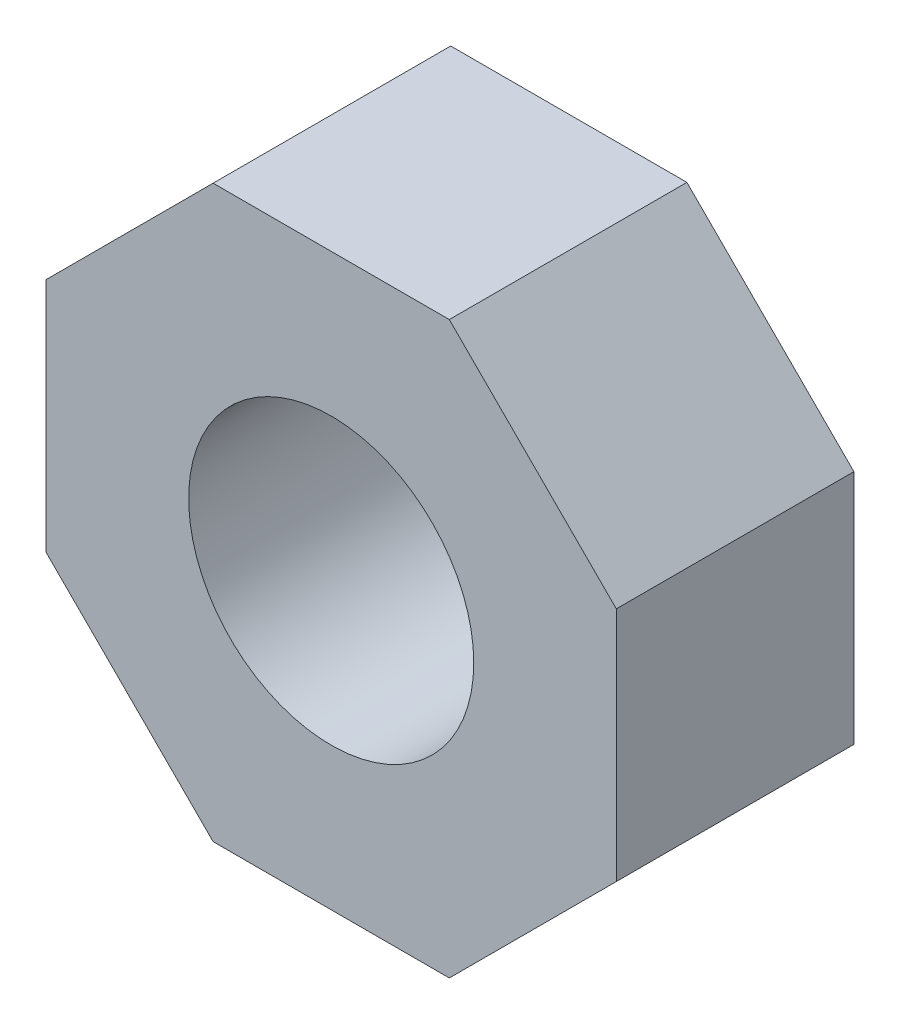
ISO-10303-21;
HEADER;
FILE_DESCRIPTION(('STEP AP214'),'2;1');
FILE_NAME('part.step','',(''),(''),'','','');
FILE_SCHEMA(('AUTOMOTIVE_DESIGN { 1 0 10303 214 1 1 1 1 }'));
ENDSEC;
DATA;
#1=APPLICATION_CONTEXT('core data for automotive mechanical design processes');
#2=APPLICATION_PROTOCOL_DEFINITION('international standard','automotive_design',2000,#1);
#3=PRODUCT_CONTEXT('',#1,'mechanical');
#4=PRODUCT('Part','Part','',(#3));
#5=PRODUCT_RELATED_PRODUCT_CATEGORY('part','',(#4));
#6=PRODUCT_DEFINITION_FORMATION('','',#4);
#7=PRODUCT_DEFINITION_CONTEXT('part definition',#1,'design');
#8=PRODUCT_DEFINITION('design','',#6,#7);
#9=PRODUCT_DEFINITION_SHAPE('','',#8);
#10=(LENGTH_UNIT() NAMED_UNIT(*) SI_UNIT(.MILLI.,.METRE.));
#11=(NAMED_UNIT(*) PLANE_ANGLE_UNIT() SI_UNIT($,.RADIAN.));
#12=(NAMED_UNIT(*) SI_UNIT($,.STERADIAN.) SOLID_ANGLE_UNIT());
#13=UNCERTAINTY_MEASURE_WITH_UNIT(LENGTH_MEASURE(1.E-05),#10,'distance_accuracy_value','');
#14=(GEOMETRIC_REPRESENTATION_CONTEXT(3) GLOBAL_UNCERTAINTY_ASSIGNED_CONTEXT((#13)) GLOBAL_UNIT_ASSIGNED_CONTEXT((#10,
#11,#12)) REPRESENTATION_CONTEXT('',''));
#15=CARTESIAN_POINT('',(0.,0.,0.));
#16=DIRECTION('',(0.,0.,1.));
#17=DIRECTION('',(1.,0.,0.));
#18=AXIS2_PLACEMENT_3D('',#15,#16,#17);
#19=CARTESIAN_POINT('',(-6.,0.,5.));
#20=DIRECTION('',(-1.,0.,0.));
#21=DIRECTION('',(0.,0.,1.));
#22=AXIS2_PLACEMENT_3D('',#19,#20,#21);
#23=PLANE('',#22);
#24=DIRECTION('',(0.,1.,0.));
#25=VECTOR('',#24,1.);
#26=CARTESIAN_POINT('',(-6.,0.,0.));
#27=LINE('',#26,#25);
#28=CARTESIAN_POINT('',(-6.,-2.48528137423859,0.));
#29=VERTEX_POINT('',#28);
#30=CARTESIAN_POINT('',(-6.,2.48528137423859,0.));
#31=VERTEX_POINT('',#30);
#32=EDGE_CURVE('E133',#29,#31,#27,.T.);
#33=ORIENTED_EDGE('',*,*,#32,.F.);
#34=DIRECTION('',(0.,0.,-1.));
#35=VECTOR('',#34,1.);
#36=CARTESIAN_POINT('',(-6.,-2.48528137423859,5.));
#37=LINE('',#36,#35);
#38=CARTESIAN_POINT('',(-6.,-2.48528137423859,5.));
#39=VERTEX_POINT('',#38);
#40=EDGE_CURVE('E11',#39,#29,#37,.T.);
#41=ORIENTED_EDGE('',*,*,#40,.F.);
#42=DIRECTION('',(0.,1.,0.));
#43=VECTOR('',#42,1.);
#44=CARTESIAN_POINT('',(-6.,0.,5.));
#45=LINE('',#44,#43);
#46=CARTESIAN_POINT('',(-6.,2.48528137423859,5.));
#47=VERTEX_POINT('',#46);
#48=EDGE_CURVE('E299',#39,#47,#45,.T.);
#49=ORIENTED_EDGE('',*,*,#48,.T.);
#50=DIRECTION('',(0.,0.,-1.));
#51=VECTOR('',#50,1.);
#52=CARTESIAN_POINT('',(-6.,2.48528137423859,5.));
#53=LINE('',#52,#51);
#54=EDGE_CURVE('E53',#47,#31,#53,.T.);
#55=ORIENTED_EDGE('',*,*,#54,.T.);
#56=EDGE_LOOP('',(#33,#41,#49,#55));
#57=FACE_BOUND('',#56,.T.);
#58=ADVANCED_FACE('F36',(#57),#23,.T.);
#59=CARTESIAN_POINT('',(-4.24264068711926,-4.24264068711931,5.));
#60=DIRECTION('',(-0.707106781186543,-0.707106781186552,0.));
#61=DIRECTION('',(0.707106781186552,-0.707106781186543,0.));
#62=AXIS2_PLACEMENT_3D('',#59,#60,#61);
#63=PLANE('',#62);
#64=DIRECTION('',(-0.707106781186552,0.707106781186543,0.));
#65=VECTOR('',#64,1.);
#66=CARTESIAN_POINT('',(-4.24264068711926,-4.24264068711931,0.));
#67=LINE('',#66,#65);
#68=CARTESIAN_POINT('',(-2.48528137423858,-6.,0.));
#69=VERTEX_POINT('',#68);
#70=EDGE_CURVE('E135',#69,#29,#67,.T.);
#71=ORIENTED_EDGE('',*,*,#70,.F.);
#72=DIRECTION('',(0.,0.,-1.));
#73=VECTOR('',#72,1.);
#74=CARTESIAN_POINT('',(-2.48528137423858,-6.,5.));
#75=LINE('',#74,#73);
#76=CARTESIAN_POINT('',(-2.48528137423858,-6.,5.));
#77=VERTEX_POINT('',#76);
#78=EDGE_CURVE('E45',#77,#69,#75,.T.);
#79=ORIENTED_EDGE('',*,*,#78,.F.);
#80=DIRECTION('',(-0.707106781186552,0.707106781186543,0.));
#81=VECTOR('',#80,1.);
#82=CARTESIAN_POINT('',(-4.24264068711926,-4.24264068711931,5.));
#83=LINE('',#82,#81);
#84=EDGE_CURVE('E174',#77,#39,#83,.T.);
#85=ORIENTED_EDGE('',*,*,#84,.T.);
#86=ORIENTED_EDGE('',*,*,#40,.T.);
#87=EDGE_LOOP('',(#71,#79,#85,#86));
#88=FACE_BOUND('',#87,.T.);
#89=ADVANCED_FACE('F173',(#88),#63,.T.);
#90=CARTESIAN_POINT('',(0.,-6.,5.));
#91=DIRECTION('',(0.,1.,0.));
#92=DIRECTION('',(0.,0.,1.));
#93=AXIS2_PLACEMENT_3D('',#90,#91,#92);
#94=PLANE('',#93);
#95=DIRECTION('',(1.,0.,0.));
#96=VECTOR('',#95,1.);
#97=CARTESIAN_POINT('',(0.,-6.,0.));
#98=LINE('',#97,#96);
#99=CARTESIAN_POINT('',(2.48528137423857,-6.,0.));
#100=VERTEX_POINT('',#99);
#101=EDGE_CURVE('E138',#69,#100,#98,.T.);
#102=ORIENTED_EDGE('',*,*,#101,.T.);
#103=DIRECTION('',(0.,0.,-1.));
#104=VECTOR('',#103,1.);
#105=CARTESIAN_POINT('',(2.48528137423857,-6.,5.));
#106=LINE('',#105,#104);
#107=CARTESIAN_POINT('',(2.48528137423857,-6.,5.));
#108=VERTEX_POINT('',#107);
#109=EDGE_CURVE('E159',#108,#100,#106,.T.);
#110=ORIENTED_EDGE('',*,*,#109,.F.);
#111=DIRECTION('',(1.,0.,0.));
#112=VECTOR('',#111,1.);
#113=CARTESIAN_POINT('',(0.,-6.,5.));
#114=LINE('',#113,#112);
#115=EDGE_CURVE('E165',#77,#108,#114,.T.);
#116=ORIENTED_EDGE('',*,*,#115,.F.);
#117=ORIENTED_EDGE('',*,*,#78,.T.);
#118=EDGE_LOOP('',(#102,#110,#116,#117));
#119=FACE_BOUND('',#118,.T.);
#120=ADVANCED_FACE('F163',(#119),#94,.F.);
#121=CARTESIAN_POINT('',(4.24264068711929,-4.24264068711928,5.));
#122=DIRECTION('',(0.707106781186548,-0.707106781186547,0.));
#123=DIRECTION('',(0.707106781186547,0.707106781186548,0.));
#124=AXIS2_PLACEMENT_3D('',#121,#122,#123);
#125=PLANE('',#124);
#126=DIRECTION('',(-0.707106781186547,-0.707106781186548,0.));
#127=VECTOR('',#126,1.);
#128=CARTESIAN_POINT('',(4.24264068711929,-4.24264068711928,0.));
#129=LINE('',#128,#127);
#130=CARTESIAN_POINT('',(6.,-2.48528137423857,0.));
#131=VERTEX_POINT('',#130);
#132=EDGE_CURVE('E141',#131,#100,#129,.T.);
#133=ORIENTED_EDGE('',*,*,#132,.F.);
#134=DIRECTION('',(0.,0.,-1.));
#135=VECTOR('',#134,1.);
#136=CARTESIAN_POINT('',(6.,-2.48528137423857,5.));
#137=LINE('',#136,#135);
#138=CARTESIAN_POINT('',(6.,-2.48528137423857,5.));
#139=VERTEX_POINT('',#138);
#140=EDGE_CURVE('E157',#139,#131,#137,.T.);
#141=ORIENTED_EDGE('',*,*,#140,.F.);
#142=DIRECTION('',(-0.707106781186547,-0.707106781186548,0.));
#143=VECTOR('',#142,1.);
#144=CARTESIAN_POINT('',(4.24264068711929,-4.24264068711928,5.));
#145=LINE('',#144,#143);
#146=EDGE_CURVE('E294',#139,#108,#145,.T.);
#147=ORIENTED_EDGE('',*,*,#146,.T.);
#148=ORIENTED_EDGE('',*,*,#109,.T.);
#149=EDGE_LOOP('',(#133,#141,#147,#148));
#150=FACE_BOUND('',#149,.T.);
#151=ADVANCED_FACE('F195',(#150),#125,.T.);
#152=CARTESIAN_POINT('',(6.,0.,5.));
#153=DIRECTION('',(1.,0.,0.));
#154=DIRECTION('',(0.,1.,0.));
#155=AXIS2_PLACEMENT_3D('',#152,#153,#154);
#156=PLANE('',#155);
#157=DIRECTION('',(0.,-1.,0.));
#158=VECTOR('',#157,1.);
#159=CARTESIAN_POINT('',(6.,0.,0.));
#160=LINE('',#159,#158);
#161=CARTESIAN_POINT('',(6.,2.48528137423857,0.));
#162=VERTEX_POINT('',#161);
#163=EDGE_CURVE('E144',#162,#131,#160,.T.);
#164=ORIENTED_EDGE('',*,*,#163,.F.);
#165=DIRECTION('',(0.,0.,-1.));
#166=VECTOR('',#165,1.);
#167=CARTESIAN_POINT('',(6.,2.48528137423857,5.));
#168=LINE('',#167,#166);
#169=CARTESIAN_POINT('',(6.,2.48528137423857,5.));
#170=VERTEX_POINT('',#169);
#171=EDGE_CURVE('E112',#170,#162,#168,.T.);
#172=ORIENTED_EDGE('',*,*,#171,.F.);
#173=DIRECTION('',(0.,-1.,0.));
#174=VECTOR('',#173,1.);
#175=CARTESIAN_POINT('',(6.,0.,5.));
#176=LINE('',#175,#174);
#177=EDGE_CURVE('E122',#170,#139,#176,.T.);
#178=ORIENTED_EDGE('',*,*,#177,.T.);
#179=ORIENTED_EDGE('',*,*,#140,.T.);
#180=EDGE_LOOP('',(#164,#172,#178,#179));
#181=FACE_BOUND('',#180,.T.);
#182=ADVANCED_FACE('F198',(#181),#156,.T.);
#183=CARTESIAN_POINT('',(4.24264068711928,4.24264068711929,5.));
#184=DIRECTION('',(0.707106781186547,0.707106781186548,0.));
#185=DIRECTION('',(-0.707106781186548,0.707106781186547,0.));
#186=AXIS2_PLACEMENT_3D('',#183,#184,#185);
#187=PLANE('',#186);
#188=DIRECTION('',(0.707106781186548,-0.707106781186547,0.));
#189=VECTOR('',#188,1.);
#190=CARTESIAN_POINT('',(4.24264068711928,4.24264068711929,0.));
#191=LINE('',#190,#189);
#192=CARTESIAN_POINT('',(2.48528137423857,6.,0.));
#193=VERTEX_POINT('',#192);
#194=EDGE_CURVE('E108',#193,#162,#191,.T.);
#195=ORIENTED_EDGE('',*,*,#194,.F.);
#196=DIRECTION('',(0.,0.,-1.));
#197=VECTOR('',#196,1.);
#198=CARTESIAN_POINT('',(2.48528137423857,6.,5.));
#199=LINE('',#198,#197);
#200=CARTESIAN_POINT('',(2.48528137423857,6.,5.));
#201=VERTEX_POINT('',#200);
#202=EDGE_CURVE('E103',#201,#193,#199,.T.);
#203=ORIENTED_EDGE('',*,*,#202,.F.);
#204=DIRECTION('',(0.707106781186548,-0.707106781186547,0.));
#205=VECTOR('',#204,1.);
#206=CARTESIAN_POINT('',(4.24264068711928,4.24264068711929,5.));
#207=LINE('',#206,#205);
#208=EDGE_CURVE('E106',#201,#170,#207,.T.);
#209=ORIENTED_EDGE('',*,*,#208,.T.);
#210=ORIENTED_EDGE('',*,*,#171,.T.);
#211=EDGE_LOOP('',(#195,#203,#209,#210));
#212=FACE_BOUND('',#211,.T.);
#213=ADVANCED_FACE('F105',(#212),#187,.T.);
#214=CARTESIAN_POINT('',(0.,6.,5.));
#215=DIRECTION('',(0.,1.,0.));
#216=DIRECTION('',(-1.,0.,0.));
#217=AXIS2_PLACEMENT_3D('',#214,#215,#216);
#218=PLANE('',#217);
#219=DIRECTION('',(1.,0.,0.));
#220=VECTOR('',#219,1.);
#221=CARTESIAN_POINT('',(0.,6.,0.));
#222=LINE('',#221,#220);
#223=CARTESIAN_POINT('',(-2.48528137423856,6.,0.));
#224=VERTEX_POINT('',#223);
#225=EDGE_CURVE('E148',#224,#193,#222,.T.);
#226=ORIENTED_EDGE('',*,*,#225,.F.);
#227=DIRECTION('',(0.,0.,-1.));
#228=VECTOR('',#227,1.);
#229=CARTESIAN_POINT('',(-2.48528137423856,6.,5.));
#230=LINE('',#229,#228);
#231=CARTESIAN_POINT('',(-2.48528137423856,6.,5.));
#232=VERTEX_POINT('',#231);
#233=EDGE_CURVE('E78',#232,#224,#230,.T.);
#234=ORIENTED_EDGE('',*,*,#233,.F.);
#235=DIRECTION('',(1.,0.,0.));
#236=VECTOR('',#235,1.);
#237=CARTESIAN_POINT('',(0.,6.,5.));
#238=LINE('',#237,#236);
#239=EDGE_CURVE('E119',#232,#201,#238,.T.);
#240=ORIENTED_EDGE('',*,*,#239,.T.);
#241=ORIENTED_EDGE('',*,*,#202,.T.);
#242=EDGE_LOOP('',(#226,#234,#240,#241));
#243=FACE_BOUND('',#242,.T.);
#244=ADVANCED_FACE('F124',(#243),#218,.T.);
#245=CARTESIAN_POINT('',(0.,0.,5.));
#246=DIRECTION('',(0.,0.,-1.));
#247=DIRECTION('',(-1.,0.,0.));
#248=AXIS2_PLACEMENT_3D('',#245,#246,#247);
#249=CYLINDRICAL_SURFACE('',#248,3.);
#250=CARTESIAN_POINT('',(0.,0.,5.));
#251=DIRECTION('',(0.,0.,1.));
#252=DIRECTION('',(1.,0.,0.));
#253=AXIS2_PLACEMENT_3D('',#250,#251,#252);
#254=CIRCLE('',#253,3.);
#255=CARTESIAN_POINT('',(3.,0.,5.));
#256=VERTEX_POINT('',#255);
#257=EDGE_CURVE('E153',#256,#256,#254,.T.);
#258=ORIENTED_EDGE('',*,*,#257,.T.);
#259=EDGE_LOOP('',(#258));
#260=FACE_BOUND('',#259,.T.);
#261=CARTESIAN_POINT('',(0.,0.,0.));
#262=DIRECTION('',(0.,0.,1.));
#263=DIRECTION('',(1.,0.,0.));
#264=AXIS2_PLACEMENT_3D('',#261,#262,#263);
#265=CIRCLE('',#264,3.);
#266=CARTESIAN_POINT('',(3.,0.,0.));
#267=VERTEX_POINT('',#266);
#268=EDGE_CURVE('E130',#267,#267,#265,.T.);
#269=ORIENTED_EDGE('',*,*,#268,.F.);
#270=EDGE_LOOP('',(#269));
#271=FACE_BOUND('',#270,.T.);
#272=ADVANCED_FACE('F38',(#260,#271),#249,.F.);
#273=CARTESIAN_POINT('',(-4.24264068711927,4.2426406871193,5.));
#274=DIRECTION('',(-0.707106781186545,0.70710678118655,0.));
#275=DIRECTION('',(-0.70710678118655,-0.707106781186545,0.));
#276=AXIS2_PLACEMENT_3D('',#273,#274,#275);
#277=PLANE('',#276);
#278=DIRECTION('',(0.70710678118655,0.707106781186545,0.));
#279=VECTOR('',#278,1.);
#280=CARTESIAN_POINT('',(-4.24264068711927,4.2426406871193,0.));
#281=LINE('',#280,#279);
#282=EDGE_CURVE('E150',#31,#224,#281,.T.);
#283=ORIENTED_EDGE('',*,*,#282,.F.);
#284=ORIENTED_EDGE('',*,*,#54,.F.);
#285=DIRECTION('',(0.70710678118655,0.707106781186545,0.));
#286=VECTOR('',#285,1.);
#287=CARTESIAN_POINT('',(-4.24264068711927,4.2426406871193,5.));
#288=LINE('',#287,#286);
#289=EDGE_CURVE('E125',#47,#232,#288,.T.);
#290=ORIENTED_EDGE('',*,*,#289,.T.);
#291=ORIENTED_EDGE('',*,*,#233,.T.);
#292=EDGE_LOOP('',(#283,#284,#290,#291));
#293=FACE_BOUND('',#292,.T.);
#294=ADVANCED_FACE('F175',(#293),#277,.T.);
#295=CARTESIAN_POINT('',(0.,0.,5.));
#296=DIRECTION('',(0.,0.,1.));
#297=DIRECTION('',(1.,0.,0.));
#298=AXIS2_PLACEMENT_3D('',#295,#296,#297);
#299=PLANE('',#298);
#300=ORIENTED_EDGE('',*,*,#257,.F.);
#301=EDGE_LOOP('',(#300));
#302=FACE_BOUND('',#301,.T.);
#303=ORIENTED_EDGE('',*,*,#48,.F.);
#304=ORIENTED_EDGE('',*,*,#84,.F.);
#305=ORIENTED_EDGE('',*,*,#115,.T.);
#306=ORIENTED_EDGE('',*,*,#146,.F.);
#307=ORIENTED_EDGE('',*,*,#177,.F.);
#308=ORIENTED_EDGE('',*,*,#208,.F.);
#309=ORIENTED_EDGE('',*,*,#239,.F.);
#310=ORIENTED_EDGE('',*,*,#289,.F.);
#311=EDGE_LOOP('',(#303,#304,#305,#306,#307,#308,#309,#310));
#312=FACE_BOUND('',#311,.T.);
#313=ADVANCED_FACE('F117',(#302,#312),#299,.T.);
#314=CARTESIAN_POINT('',(0.,0.,0.));
#315=DIRECTION('',(0.,0.,1.));
#316=DIRECTION('',(1.,0.,0.));
#317=AXIS2_PLACEMENT_3D('',#314,#315,#316);
#318=PLANE('',#317);
#319=ORIENTED_EDGE('',*,*,#268,.T.);
#320=EDGE_LOOP('',(#319));
#321=FACE_BOUND('',#320,.T.);
#322=ORIENTED_EDGE('',*,*,#32,.T.);
#323=ORIENTED_EDGE('',*,*,#282,.T.);
#324=ORIENTED_EDGE('',*,*,#225,.T.);
#325=ORIENTED_EDGE('',*,*,#194,.T.);
#326=ORIENTED_EDGE('',*,*,#163,.T.);
#327=ORIENTED_EDGE('',*,*,#132,.T.);
#328=ORIENTED_EDGE('',*,*,#101,.F.);
#329=ORIENTED_EDGE('',*,*,#70,.T.);
#330=EDGE_LOOP('',(#322,#323,#324,#325,#326,#327,#328,#329));
#331=FACE_BOUND('',#330,.T.);
#332=ADVANCED_FACE('F171',(#321,#331),#318,.F.);
#333=CLOSED_SHELL('',(#58,#89,#120,#151,#182,#213,#244,#272,#294,#313,#332));
#334=MANIFOLD_SOLID_BREP('B2',#333);
#335=ADVANCED_BREP_SHAPE_REPRESENTATION('',(#18,#334),#14);
#336=SHAPE_DEFINITION_REPRESENTATION(#9,#335);
ENDSEC;
END-ISO-10303-21;
